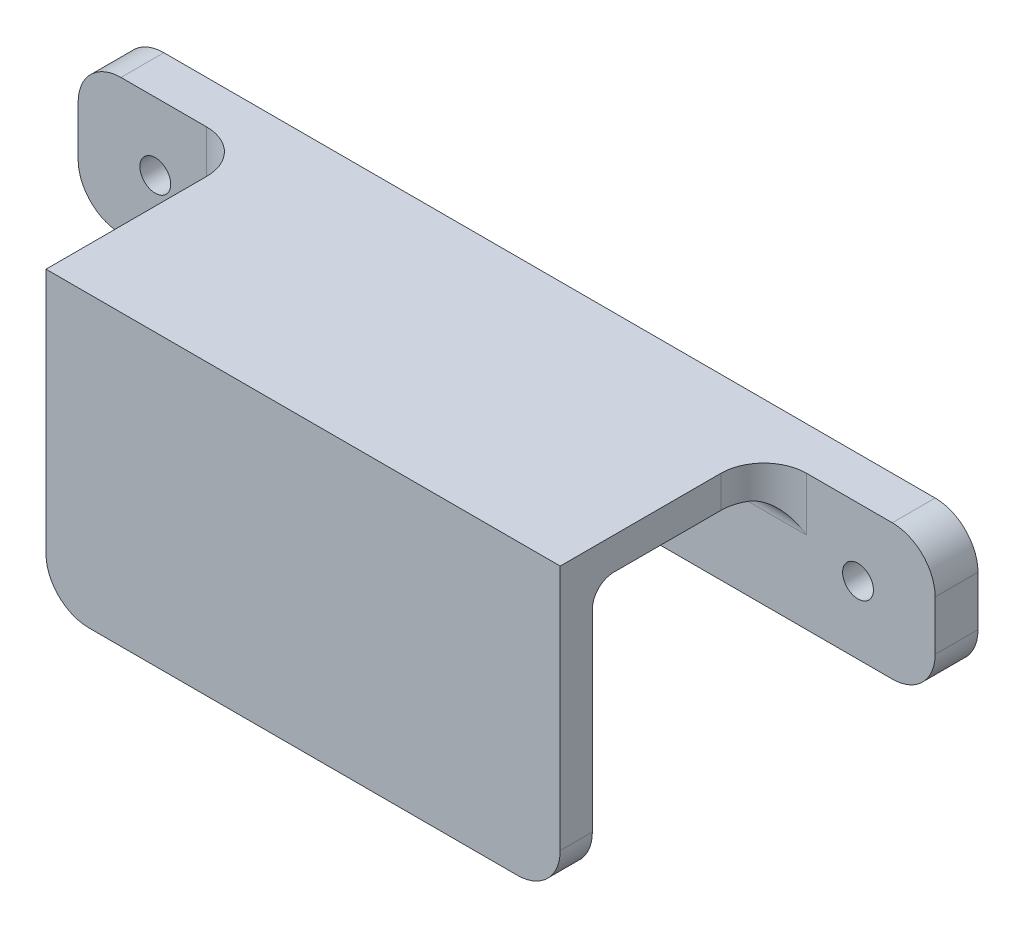
ISO-10303-21;
HEADER;
FILE_DESCRIPTION(('STEP AP214'),'2;1');
FILE_NAME('part.step','',(''),(''),'','','');
FILE_SCHEMA(('AUTOMOTIVE_DESIGN { 1 0 10303 214 1 1 1 1 }'));
ENDSEC;
DATA;
#1=APPLICATION_CONTEXT('core data for automotive mechanical design processes');
#2=APPLICATION_PROTOCOL_DEFINITION('international standard','automotive_design',2000,#1);
#3=PRODUCT_CONTEXT('',#1,'mechanical');
#4=PRODUCT('Part','Part','',(#3));
#5=PRODUCT_RELATED_PRODUCT_CATEGORY('part','',(#4));
#6=PRODUCT_DEFINITION_FORMATION('','',#4);
#7=PRODUCT_DEFINITION_CONTEXT('part definition',#1,'design');
#8=PRODUCT_DEFINITION('design','',#6,#7);
#9=PRODUCT_DEFINITION_SHAPE('','',#8);
#10=(LENGTH_UNIT() NAMED_UNIT(*) SI_UNIT(.MILLI.,.METRE.));
#11=(NAMED_UNIT(*) PLANE_ANGLE_UNIT() SI_UNIT($,.RADIAN.));
#12=(NAMED_UNIT(*) SI_UNIT($,.STERADIAN.) SOLID_ANGLE_UNIT());
#13=UNCERTAINTY_MEASURE_WITH_UNIT(LENGTH_MEASURE(1.E-05),#10,'distance_accuracy_value','');
#14=(GEOMETRIC_REPRESENTATION_CONTEXT(3) GLOBAL_UNCERTAINTY_ASSIGNED_CONTEXT((#13)) GLOBAL_UNIT_ASSIGNED_CONTEXT((#10,
#11,#12)) REPRESENTATION_CONTEXT('',''));
#15=CARTESIAN_POINT('',(0.,0.,0.));
#16=DIRECTION('',(0.,0.,1.));
#17=DIRECTION('',(1.,0.,0.));
#18=AXIS2_PLACEMENT_3D('',#15,#16,#17);
#19=CARTESIAN_POINT('',(0.,0.,6.35));
#20=DIRECTION('',(0.,0.,-1.));
#21=DIRECTION('',(-1.,0.,0.));
#22=AXIS2_PLACEMENT_3D('',#19,#20,#21);
#23=PLANE('',#22);
#24=CARTESIAN_POINT('',(52.07,0.,6.35));
#25=DIRECTION('',(0.,0.,-1.));
#26=DIRECTION('',(-1.,0.,0.));
#27=AXIS2_PLACEMENT_3D('',#24,#25,#26);
#28=CIRCLE('',#27,2.28599999999999);
#29=CARTESIAN_POINT('',(49.784,0.,6.35));
#30=VERTEX_POINT('',#29);
#31=EDGE_CURVE('E203',#30,#30,#28,.T.);
#32=ORIENTED_EDGE('',*,*,#31,.T.);
#33=EDGE_LOOP('',(#32));
#34=FACE_BOUND('',#33,.T.);
#35=CARTESIAN_POINT('',(-52.07,0.,6.35));
#36=DIRECTION('',(0.,0.,-1.));
#37=DIRECTION('',(-1.,0.,0.));
#38=AXIS2_PLACEMENT_3D('',#35,#36,#37);
#39=CIRCLE('',#38,2.28599999999999);
#40=CARTESIAN_POINT('',(-54.356,0.,6.35));
#41=VERTEX_POINT('',#40);
#42=EDGE_CURVE('E429',#41,#41,#39,.T.);
#43=ORIENTED_EDGE('',*,*,#42,.T.);
#44=EDGE_LOOP('',(#43));
#45=FACE_BOUND('',#44,.T.);
#46=DIRECTION('',(1.,0.,0.));
#47=VECTOR('',#46,1.);
#48=CARTESIAN_POINT('',(-38.1,2.0955,6.35));
#49=LINE('',#48,#47);
#50=CARTESIAN_POINT('',(44.45,2.0955,6.35));
#51=VERTEX_POINT('',#50);
#52=CARTESIAN_POINT('',(-44.45,2.0955,6.35));
#53=VERTEX_POINT('',#52);
#54=EDGE_CURVE('E295',#51,#53,#49,.F.);
#55=ORIENTED_EDGE('',*,*,#54,.T.);
#56=DIRECTION('',(0.,-1.,0.));
#57=VECTOR('',#56,1.);
#58=CARTESIAN_POINT('',(-44.45,10.033,6.35));
#59=LINE('',#58,#57);
#60=CARTESIAN_POINT('',(-44.45,10.033,6.35));
#61=VERTEX_POINT('',#60);
#62=EDGE_CURVE('E310',#53,#61,#59,.F.);
#63=ORIENTED_EDGE('',*,*,#62,.T.);
#64=DIRECTION('',(-1.,0.,0.));
#65=VECTOR('',#64,1.);
#66=CARTESIAN_POINT('',(-63.5,10.033,6.35));
#67=LINE('',#66,#65);
#68=CARTESIAN_POINT('',(-57.15,10.033,6.35));
#69=VERTEX_POINT('',#68);
#70=EDGE_CURVE('E218',#61,#69,#67,.T.);
#71=ORIENTED_EDGE('',*,*,#70,.T.);
#72=CARTESIAN_POINT('',(-57.15,3.683,6.35));
#73=DIRECTION('',(0.,0.,-1.));
#74=DIRECTION('',(-1.,0.,0.));
#75=AXIS2_PLACEMENT_3D('',#72,#73,#74);
#76=CIRCLE('',#75,6.35);
#77=CARTESIAN_POINT('',(-63.5,3.683,6.35));
#78=VERTEX_POINT('',#77);
#79=EDGE_CURVE('E263',#69,#78,#76,.F.);
#80=ORIENTED_EDGE('',*,*,#79,.T.);
#81=DIRECTION('',(0.,-1.,0.));
#82=VECTOR('',#81,1.);
#83=CARTESIAN_POINT('',(-63.5,-10.033,6.35));
#84=LINE('',#83,#82);
#85=CARTESIAN_POINT('',(-63.5,-3.683,6.35));
#86=VERTEX_POINT('',#85);
#87=EDGE_CURVE('E223',#78,#86,#84,.T.);
#88=ORIENTED_EDGE('',*,*,#87,.T.);
#89=CARTESIAN_POINT('',(-57.15,-3.683,6.35));
#90=DIRECTION('',(0.,0.,-1.));
#91=DIRECTION('',(-1.,0.,0.));
#92=AXIS2_PLACEMENT_3D('',#89,#90,#91);
#93=CIRCLE('',#92,6.35);
#94=CARTESIAN_POINT('',(-57.15,-10.033,6.35));
#95=VERTEX_POINT('',#94);
#96=EDGE_CURVE('E261',#86,#95,#93,.F.);
#97=ORIENTED_EDGE('',*,*,#96,.T.);
#98=DIRECTION('',(1.,0.,0.));
#99=VECTOR('',#98,1.);
#100=CARTESIAN_POINT('',(-63.5,-10.033,6.35));
#101=LINE('',#100,#99);
#102=CARTESIAN_POINT('',(57.15,-10.033,6.35));
#103=VERTEX_POINT('',#102);
#104=EDGE_CURVE('E226',#95,#103,#101,.T.);
#105=ORIENTED_EDGE('',*,*,#104,.T.);
#106=CARTESIAN_POINT('',(57.15,-3.683,6.35));
#107=DIRECTION('',(0.,0.,-1.));
#108=DIRECTION('',(-1.,0.,0.));
#109=AXIS2_PLACEMENT_3D('',#106,#107,#108);
#110=CIRCLE('',#109,6.35);
#111=CARTESIAN_POINT('',(63.5,-3.683,6.35));
#112=VERTEX_POINT('',#111);
#113=EDGE_CURVE('E259',#103,#112,#110,.F.);
#114=ORIENTED_EDGE('',*,*,#113,.T.);
#115=DIRECTION('',(0.,1.,0.));
#116=VECTOR('',#115,1.);
#117=CARTESIAN_POINT('',(63.5,-10.033,6.35));
#118=LINE('',#117,#116);
#119=CARTESIAN_POINT('',(63.5,3.683,6.35));
#120=VERTEX_POINT('',#119);
#121=EDGE_CURVE('E215',#112,#120,#118,.T.);
#122=ORIENTED_EDGE('',*,*,#121,.T.);
#123=CARTESIAN_POINT('',(57.15,3.683,6.35));
#124=DIRECTION('',(0.,0.,-1.));
#125=DIRECTION('',(-1.,0.,0.));
#126=AXIS2_PLACEMENT_3D('',#123,#124,#125);
#127=CIRCLE('',#126,6.35);
#128=CARTESIAN_POINT('',(57.15,10.033,6.35));
#129=VERTEX_POINT('',#128);
#130=EDGE_CURVE('E257',#120,#129,#127,.F.);
#131=ORIENTED_EDGE('',*,*,#130,.T.);
#132=CARTESIAN_POINT('',(44.45,10.033,6.35));
#133=VERTEX_POINT('',#132);
#134=EDGE_CURVE('E220',#129,#133,#67,.T.);
#135=ORIENTED_EDGE('',*,*,#134,.T.);
#136=DIRECTION('',(0.,1.,0.));
#137=VECTOR('',#136,1.);
#138=CARTESIAN_POINT('',(44.45,2.0955,6.35));
#139=LINE('',#138,#137);
#140=EDGE_CURVE('E307',#133,#51,#139,.F.);
#141=ORIENTED_EDGE('',*,*,#140,.T.);
#142=EDGE_LOOP('',(#55,#63,#71,#80,#88,#97,#105,#114,#122,#131,#135,#141));
#143=FACE_BOUND('',#142,.T.);
#144=ADVANCED_FACE('F32',(#34,#45,#143),#23,.F.);
#145=CARTESIAN_POINT('',(63.5,-10.033,6.35));
#146=DIRECTION('',(-1.,0.,0.));
#147=DIRECTION('',(0.,0.,1.));
#148=AXIS2_PLACEMENT_3D('',#145,#146,#147);
#149=PLANE('',#148);
#150=ORIENTED_EDGE('',*,*,#121,.F.);
#151=DIRECTION('',(0.,0.,-1.));
#152=VECTOR('',#151,1.);
#153=CARTESIAN_POINT('',(63.5,-3.683,6.35));
#154=LINE('',#153,#152);
#155=CARTESIAN_POINT('',(63.5,-3.683,0.));
#156=VERTEX_POINT('',#155);
#157=EDGE_CURVE('E272',#112,#156,#154,.T.);
#158=ORIENTED_EDGE('',*,*,#157,.T.);
#159=DIRECTION('',(0.,1.,0.));
#160=VECTOR('',#159,1.);
#161=CARTESIAN_POINT('',(63.5,-10.033,0.));
#162=LINE('',#161,#160);
#163=CARTESIAN_POINT('',(63.5,3.683,0.));
#164=VERTEX_POINT('',#163);
#165=EDGE_CURVE('E214',#156,#164,#162,.T.);
#166=ORIENTED_EDGE('',*,*,#165,.T.);
#167=DIRECTION('',(0.,0.,-1.));
#168=VECTOR('',#167,1.);
#169=CARTESIAN_POINT('',(63.5,3.683,6.35));
#170=LINE('',#169,#168);
#171=EDGE_CURVE('E270',#164,#120,#170,.F.);
#172=ORIENTED_EDGE('',*,*,#171,.T.);
#173=EDGE_LOOP('',(#150,#158,#166,#172));
#174=FACE_BOUND('',#173,.T.);
#175=ADVANCED_FACE('F341',(#174),#149,.F.);
#176=CARTESIAN_POINT('',(-63.5,10.033,6.35));
#177=DIRECTION('',(0.,-1.,0.));
#178=DIRECTION('',(0.,0.,-1.));
#179=AXIS2_PLACEMENT_3D('',#176,#177,#178);
#180=PLANE('',#179);
#181=DIRECTION('',(-1.,0.,0.));
#182=VECTOR('',#181,1.);
#183=CARTESIAN_POINT('',(-63.5,10.033,0.));
#184=LINE('',#183,#182);
#185=CARTESIAN_POINT('',(57.15,10.033,0.));
#186=VERTEX_POINT('',#185);
#187=CARTESIAN_POINT('',(-57.15,10.033,0.));
#188=VERTEX_POINT('',#187);
#189=EDGE_CURVE('E232',#186,#188,#184,.T.);
#190=ORIENTED_EDGE('',*,*,#189,.T.);
#191=DIRECTION('',(0.,0.,-1.));
#192=VECTOR('',#191,1.);
#193=CARTESIAN_POINT('',(-57.15,10.033,6.35));
#194=LINE('',#193,#192);
#195=EDGE_CURVE('E254',#188,#69,#194,.F.);
#196=ORIENTED_EDGE('',*,*,#195,.T.);
#197=ORIENTED_EDGE('',*,*,#70,.F.);
#198=CARTESIAN_POINT('',(-44.45,10.033,12.7));
#199=DIRECTION('',(0.,-1.,0.));
#200=DIRECTION('',(0.,0.,-1.));
#201=AXIS2_PLACEMENT_3D('',#198,#199,#200);
#202=CIRCLE('',#201,6.35);
#203=CARTESIAN_POINT('',(-38.1,10.033,12.7));
#204=VERTEX_POINT('',#203);
#205=EDGE_CURVE('E322',#61,#204,#202,.T.);
#206=ORIENTED_EDGE('',*,*,#205,.T.);
#207=DIRECTION('',(0.,0.,-1.));
#208=VECTOR('',#207,1.);
#209=CARTESIAN_POINT('',(-38.1,10.033,31.75));
#210=LINE('',#209,#208);
#211=CARTESIAN_POINT('',(-38.1,10.033,36.5125));
#212=VERTEX_POINT('',#211);
#213=EDGE_CURVE('E191',#212,#204,#210,.T.);
#214=ORIENTED_EDGE('',*,*,#213,.F.);
#215=DIRECTION('',(-1.,0.,0.));
#216=VECTOR('',#215,1.);
#217=CARTESIAN_POINT('',(-38.1,10.033,36.5125));
#218=LINE('',#217,#216);
#219=CARTESIAN_POINT('',(38.1,10.033,36.5125));
#220=VERTEX_POINT('',#219);
#221=EDGE_CURVE('E172',#220,#212,#218,.T.);
#222=ORIENTED_EDGE('',*,*,#221,.F.);
#223=DIRECTION('',(0.,0.,-1.));
#224=VECTOR('',#223,1.);
#225=CARTESIAN_POINT('',(38.1,10.033,31.75));
#226=LINE('',#225,#224);
#227=CARTESIAN_POINT('',(38.1,10.033,12.7));
#228=VERTEX_POINT('',#227);
#229=EDGE_CURVE('E184',#220,#228,#226,.T.);
#230=ORIENTED_EDGE('',*,*,#229,.T.);
#231=CARTESIAN_POINT('',(44.45,10.033,12.7));
#232=DIRECTION('',(0.,-1.,0.));
#233=DIRECTION('',(0.,0.,-1.));
#234=AXIS2_PLACEMENT_3D('',#231,#232,#233);
#235=CIRCLE('',#234,6.35);
#236=EDGE_CURVE('E408',#228,#133,#235,.T.);
#237=ORIENTED_EDGE('',*,*,#236,.T.);
#238=ORIENTED_EDGE('',*,*,#134,.F.);
#239=DIRECTION('',(0.,0.,-1.));
#240=VECTOR('',#239,1.);
#241=CARTESIAN_POINT('',(57.15,10.033,6.35));
#242=LINE('',#241,#240);
#243=EDGE_CURVE('E251',#129,#186,#242,.T.);
#244=ORIENTED_EDGE('',*,*,#243,.T.);
#245=EDGE_LOOP('',(#190,#196,#197,#206,#214,#222,#230,#237,#238,#244));
#246=FACE_BOUND('',#245,.T.);
#247=ADVANCED_FACE('F194',(#246),#180,.F.);
#248=CARTESIAN_POINT('',(-63.5,-10.033,6.35));
#249=DIRECTION('',(1.,0.,0.));
#250=DIRECTION('',(0.,0.,-1.));
#251=AXIS2_PLACEMENT_3D('',#248,#249,#250);
#252=PLANE('',#251);
#253=ORIENTED_EDGE('',*,*,#87,.F.);
#254=DIRECTION('',(0.,0.,-1.));
#255=VECTOR('',#254,1.);
#256=CARTESIAN_POINT('',(-63.5,3.683,6.35));
#257=LINE('',#256,#255);
#258=CARTESIAN_POINT('',(-63.5,3.683,0.));
#259=VERTEX_POINT('',#258);
#260=EDGE_CURVE('E240',#78,#259,#257,.T.);
#261=ORIENTED_EDGE('',*,*,#260,.T.);
#262=DIRECTION('',(0.,-1.,0.));
#263=VECTOR('',#262,1.);
#264=CARTESIAN_POINT('',(-63.5,-10.033,0.));
#265=LINE('',#264,#263);
#266=CARTESIAN_POINT('',(-63.5,-3.683,0.));
#267=VERTEX_POINT('',#266);
#268=EDGE_CURVE('E234',#259,#267,#265,.T.);
#269=ORIENTED_EDGE('',*,*,#268,.T.);
#270=DIRECTION('',(0.,0.,-1.));
#271=VECTOR('',#270,1.);
#272=CARTESIAN_POINT('',(-63.5,-3.683,6.35));
#273=LINE('',#272,#271);
#274=EDGE_CURVE('E229',#267,#86,#273,.F.);
#275=ORIENTED_EDGE('',*,*,#274,.T.);
#276=EDGE_LOOP('',(#253,#261,#269,#275));
#277=FACE_BOUND('',#276,.T.);
#278=ADVANCED_FACE('F362',(#277),#252,.F.);
#279=CARTESIAN_POINT('',(-63.5,-10.033,6.35));
#280=DIRECTION('',(0.,1.,0.));
#281=DIRECTION('',(0.,0.,1.));
#282=AXIS2_PLACEMENT_3D('',#279,#280,#281);
#283=PLANE('',#282);
#284=ORIENTED_EDGE('',*,*,#104,.F.);
#285=DIRECTION('',(0.,0.,-1.));
#286=VECTOR('',#285,1.);
#287=CARTESIAN_POINT('',(-57.15,-10.033,6.35));
#288=LINE('',#287,#286);
#289=CARTESIAN_POINT('',(-57.15,-10.033,0.));
#290=VERTEX_POINT('',#289);
#291=EDGE_CURVE('E267',#95,#290,#288,.T.);
#292=ORIENTED_EDGE('',*,*,#291,.T.);
#293=DIRECTION('',(1.,0.,0.));
#294=VECTOR('',#293,1.);
#295=CARTESIAN_POINT('',(-63.5,-10.033,0.));
#296=LINE('',#295,#294);
#297=CARTESIAN_POINT('',(57.15,-10.033,0.));
#298=VERTEX_POINT('',#297);
#299=EDGE_CURVE('E219',#290,#298,#296,.T.);
#300=ORIENTED_EDGE('',*,*,#299,.T.);
#301=DIRECTION('',(0.,0.,-1.));
#302=VECTOR('',#301,1.);
#303=CARTESIAN_POINT('',(57.15,-10.033,6.35));
#304=LINE('',#303,#302);
#305=EDGE_CURVE('E265',#298,#103,#304,.F.);
#306=ORIENTED_EDGE('',*,*,#305,.T.);
#307=EDGE_LOOP('',(#284,#292,#300,#306));
#308=FACE_BOUND('',#307,.T.);
#309=ADVANCED_FACE('F358',(#308),#283,.F.);
#310=CARTESIAN_POINT('',(0.,0.,0.));
#311=DIRECTION('',(0.,0.,-1.));
#312=DIRECTION('',(-1.,0.,0.));
#313=AXIS2_PLACEMENT_3D('',#310,#311,#312);
#314=PLANE('',#313);
#315=CARTESIAN_POINT('',(52.07,0.,0.));
#316=DIRECTION('',(0.,0.,-1.));
#317=DIRECTION('',(-1.,0.,0.));
#318=AXIS2_PLACEMENT_3D('',#315,#316,#317);
#319=CIRCLE('',#318,2.28599999999999);
#320=CARTESIAN_POINT('',(49.784,0.,0.));
#321=VERTEX_POINT('',#320);
#322=EDGE_CURVE('E432',#321,#321,#319,.T.);
#323=ORIENTED_EDGE('',*,*,#322,.F.);
#324=EDGE_LOOP('',(#323));
#325=FACE_BOUND('',#324,.T.);
#326=CARTESIAN_POINT('',(-52.07,0.,0.));
#327=DIRECTION('',(0.,0.,-1.));
#328=DIRECTION('',(-1.,0.,0.));
#329=AXIS2_PLACEMENT_3D('',#326,#327,#328);
#330=CIRCLE('',#329,2.28599999999999);
#331=CARTESIAN_POINT('',(-54.356,0.,0.));
#332=VERTEX_POINT('',#331);
#333=EDGE_CURVE('E433',#332,#332,#330,.T.);
#334=ORIENTED_EDGE('',*,*,#333,.F.);
#335=EDGE_LOOP('',(#334));
#336=FACE_BOUND('',#335,.T.);
#337=ORIENTED_EDGE('',*,*,#268,.F.);
#338=CARTESIAN_POINT('',(-57.15,3.683,0.));
#339=DIRECTION('',(0.,0.,-1.));
#340=DIRECTION('',(-1.,0.,0.));
#341=AXIS2_PLACEMENT_3D('',#338,#339,#340);
#342=CIRCLE('',#341,6.35);
#343=EDGE_CURVE('E249',#259,#188,#342,.T.);
#344=ORIENTED_EDGE('',*,*,#343,.T.);
#345=ORIENTED_EDGE('',*,*,#189,.F.);
#346=CARTESIAN_POINT('',(57.15,3.683,0.));
#347=DIRECTION('',(0.,0.,-1.));
#348=DIRECTION('',(-1.,0.,0.));
#349=AXIS2_PLACEMENT_3D('',#346,#347,#348);
#350=CIRCLE('',#349,6.35);
#351=EDGE_CURVE('E243',#186,#164,#350,.T.);
#352=ORIENTED_EDGE('',*,*,#351,.T.);
#353=ORIENTED_EDGE('',*,*,#165,.F.);
#354=CARTESIAN_POINT('',(57.15,-3.683,0.));
#355=DIRECTION('',(0.,0.,-1.));
#356=DIRECTION('',(-1.,0.,0.));
#357=AXIS2_PLACEMENT_3D('',#354,#355,#356);
#358=CIRCLE('',#357,6.35);
#359=EDGE_CURVE('E245',#156,#298,#358,.T.);
#360=ORIENTED_EDGE('',*,*,#359,.T.);
#361=ORIENTED_EDGE('',*,*,#299,.F.);
#362=CARTESIAN_POINT('',(-57.15,-3.683,0.));
#363=DIRECTION('',(0.,0.,-1.));
#364=DIRECTION('',(-1.,0.,0.));
#365=AXIS2_PLACEMENT_3D('',#362,#363,#364);
#366=CIRCLE('',#365,6.35);
#367=EDGE_CURVE('E247',#290,#267,#366,.T.);
#368=ORIENTED_EDGE('',*,*,#367,.T.);
#369=EDGE_LOOP('',(#337,#344,#345,#352,#353,#360,#361,#368));
#370=FACE_BOUND('',#369,.T.);
#371=ADVANCED_FACE('F355',(#325,#336,#370),#314,.T.);
#372=CARTESIAN_POINT('',(-38.1,10.033,31.75));
#373=DIRECTION('',(1.,0.,0.));
#374=DIRECTION('',(0.,1.,0.));
#375=AXIS2_PLACEMENT_3D('',#372,#373,#374);
#376=PLANE('',#375);
#377=ORIENTED_EDGE('',*,*,#213,.T.);
#378=DIRECTION('',(0.,-1.,0.));
#379=VECTOR('',#378,1.);
#380=CARTESIAN_POINT('',(-38.1,2.0955,12.7));
#381=LINE('',#380,#379);
#382=CARTESIAN_POINT('',(-38.1,5.2705,12.7));
#383=VERTEX_POINT('',#382);
#384=EDGE_CURVE('E304',#204,#383,#381,.T.);
#385=ORIENTED_EDGE('',*,*,#384,.T.);
#386=DIRECTION('',(0.,0.,-1.));
#387=VECTOR('',#386,1.);
#388=CARTESIAN_POINT('',(-38.1,5.2705,31.75));
#389=LINE('',#388,#387);
#390=CARTESIAN_POINT('',(-38.1,5.2705,28.575));
#391=VERTEX_POINT('',#390);
#392=EDGE_CURVE('E211',#391,#383,#389,.T.);
#393=ORIENTED_EDGE('',*,*,#392,.F.);
#394=CARTESIAN_POINT('',(-38.1,2.0955,28.575));
#395=DIRECTION('',(1.,0.,0.));
#396=DIRECTION('',(0.,1.,0.));
#397=AXIS2_PLACEMENT_3D('',#394,#395,#396);
#398=CIRCLE('',#397,3.175);
#399=CARTESIAN_POINT('',(-38.1,2.0955,31.75));
#400=VERTEX_POINT('',#399);
#401=EDGE_CURVE('E302',#391,#400,#398,.T.);
#402=ORIENTED_EDGE('',*,*,#401,.T.);
#403=DIRECTION('',(0.,-1.,0.));
#404=VECTOR('',#403,1.);
#405=CARTESIAN_POINT('',(-38.1,10.033,31.75));
#406=LINE('',#405,#404);
#407=CARTESIAN_POINT('',(-38.1,-26.4795,31.75));
#408=VERTEX_POINT('',#407);
#409=EDGE_CURVE('E200',#400,#408,#406,.T.);
#410=ORIENTED_EDGE('',*,*,#409,.T.);
#411=DIRECTION('',(0.,0.,-1.));
#412=VECTOR('',#411,1.);
#413=CARTESIAN_POINT('',(-38.1000000000001,-26.4795,31.75));
#414=LINE('',#413,#412);
#415=CARTESIAN_POINT('',(-38.1,-26.4795,36.5125));
#416=VERTEX_POINT('',#415);
#417=EDGE_CURVE('E285',#408,#416,#414,.F.);
#418=ORIENTED_EDGE('',*,*,#417,.T.);
#419=DIRECTION('',(0.,-1.,0.));
#420=VECTOR('',#419,1.);
#421=CARTESIAN_POINT('',(-38.1,10.033,36.5125));
#422=LINE('',#421,#420);
#423=EDGE_CURVE('E208',#212,#416,#422,.T.);
#424=ORIENTED_EDGE('',*,*,#423,.F.);
#425=EDGE_LOOP('',(#377,#385,#393,#402,#410,#418,#424));
#426=FACE_BOUND('',#425,.T.);
#427=ADVANCED_FACE('F353',(#426),#376,.F.);
#428=CARTESIAN_POINT('',(-38.1,5.2705,31.75));
#429=DIRECTION('',(0.,1.,0.));
#430=DIRECTION('',(0.,0.,1.));
#431=AXIS2_PLACEMENT_3D('',#428,#429,#430);
#432=PLANE('',#431);
#433=ORIENTED_EDGE('',*,*,#392,.T.);
#434=CARTESIAN_POINT('',(-44.45,5.2705,12.7));
#435=DIRECTION('',(0.,1.,0.));
#436=DIRECTION('',(0.,0.,1.));
#437=AXIS2_PLACEMENT_3D('',#434,#435,#436);
#438=CIRCLE('',#437,6.35);
#439=CARTESIAN_POINT('',(-38.9507386859688,5.2705,9.525));
#440=VERTEX_POINT('',#439);
#441=EDGE_CURVE('E313',#383,#440,#438,.T.);
#442=ORIENTED_EDGE('',*,*,#441,.T.);
#443=DIRECTION('',(1.,0.,0.));
#444=VECTOR('',#443,1.);
#445=CARTESIAN_POINT('',(38.1,5.2705,9.525));
#446=LINE('',#445,#444);
#447=CARTESIAN_POINT('',(38.9507386859688,5.2705,9.525));
#448=VERTEX_POINT('',#447);
#449=EDGE_CURVE('E47',#440,#448,#446,.T.);
#450=ORIENTED_EDGE('',*,*,#449,.T.);
#451=CARTESIAN_POINT('',(44.45,5.2705,12.7));
#452=DIRECTION('',(0.,1.,0.));
#453=DIRECTION('',(0.,0.,1.));
#454=AXIS2_PLACEMENT_3D('',#451,#452,#453);
#455=CIRCLE('',#454,6.35);
#456=CARTESIAN_POINT('',(38.1,5.2705,12.7));
#457=VERTEX_POINT('',#456);
#458=EDGE_CURVE('E11',#448,#457,#455,.T.);
#459=ORIENTED_EDGE('',*,*,#458,.T.);
#460=DIRECTION('',(0.,0.,-1.));
#461=VECTOR('',#460,1.);
#462=CARTESIAN_POINT('',(38.1,5.2705,31.75));
#463=LINE('',#462,#461);
#464=CARTESIAN_POINT('',(38.1,5.2705,28.575));
#465=VERTEX_POINT('',#464);
#466=EDGE_CURVE('E190',#465,#457,#463,.T.);
#467=ORIENTED_EDGE('',*,*,#466,.F.);
#468=DIRECTION('',(1.,0.,0.));
#469=VECTOR('',#468,1.);
#470=CARTESIAN_POINT('',(-38.1,5.2705,28.575));
#471=LINE('',#470,#469);
#472=EDGE_CURVE('E292',#465,#391,#471,.F.);
#473=ORIENTED_EDGE('',*,*,#472,.T.);
#474=EDGE_LOOP('',(#433,#442,#450,#459,#467,#473));
#475=FACE_BOUND('',#474,.T.);
#476=ADVANCED_FACE('F402',(#475),#432,.F.);
#477=CARTESIAN_POINT('',(38.1,10.033,31.75));
#478=DIRECTION('',(-1.,0.,0.));
#479=DIRECTION('',(0.,0.,1.));
#480=AXIS2_PLACEMENT_3D('',#477,#478,#479);
#481=PLANE('',#480);
#482=ORIENTED_EDGE('',*,*,#466,.T.);
#483=DIRECTION('',(0.,1.,0.));
#484=VECTOR('',#483,1.);
#485=CARTESIAN_POINT('',(38.1,10.033,12.7));
#486=LINE('',#485,#484);
#487=EDGE_CURVE('E188',#457,#228,#486,.T.);
#488=ORIENTED_EDGE('',*,*,#487,.T.);
#489=ORIENTED_EDGE('',*,*,#229,.F.);
#490=DIRECTION('',(0.,1.,0.));
#491=VECTOR('',#490,1.);
#492=CARTESIAN_POINT('',(38.1,10.033,36.5125));
#493=LINE('',#492,#491);
#494=CARTESIAN_POINT('',(38.1,-26.4795,36.5125));
#495=VERTEX_POINT('',#494);
#496=EDGE_CURVE('E167',#495,#220,#493,.T.);
#497=ORIENTED_EDGE('',*,*,#496,.F.);
#498=DIRECTION('',(0.,0.,-1.));
#499=VECTOR('',#498,1.);
#500=CARTESIAN_POINT('',(38.1,-26.4795,31.75));
#501=LINE('',#500,#499);
#502=CARTESIAN_POINT('',(38.1,-26.4795,31.75));
#503=VERTEX_POINT('',#502);
#504=EDGE_CURVE('E290',#495,#503,#501,.T.);
#505=ORIENTED_EDGE('',*,*,#504,.T.);
#506=DIRECTION('',(0.,1.,0.));
#507=VECTOR('',#506,1.);
#508=CARTESIAN_POINT('',(38.1,10.033,31.75));
#509=LINE('',#508,#507);
#510=CARTESIAN_POINT('',(38.1,2.0955,31.75));
#511=VERTEX_POINT('',#510);
#512=EDGE_CURVE('E206',#503,#511,#509,.T.);
#513=ORIENTED_EDGE('',*,*,#512,.T.);
#514=CARTESIAN_POINT('',(38.1,2.0955,28.575));
#515=DIRECTION('',(-1.,0.,0.));
#516=DIRECTION('',(0.,0.,1.));
#517=AXIS2_PLACEMENT_3D('',#514,#515,#516);
#518=CIRCLE('',#517,3.175);
#519=EDGE_CURVE('E300',#511,#465,#518,.T.);
#520=ORIENTED_EDGE('',*,*,#519,.T.);
#521=EDGE_LOOP('',(#482,#488,#489,#497,#505,#513,#520));
#522=FACE_BOUND('',#521,.T.);
#523=ADVANCED_FACE('F186',(#522),#481,.F.);
#524=CARTESIAN_POINT('',(0.,0.,31.75));
#525=DIRECTION('',(0.,0.,1.));
#526=DIRECTION('',(1.,0.,0.));
#527=AXIS2_PLACEMENT_3D('',#524,#525,#526);
#528=PLANE('',#527);
#529=ORIENTED_EDGE('',*,*,#409,.F.);
#530=DIRECTION('',(1.,0.,0.));
#531=VECTOR('',#530,1.);
#532=CARTESIAN_POINT('',(38.1,2.0955,31.75));
#533=LINE('',#532,#531);
#534=EDGE_CURVE('E297',#400,#511,#533,.T.);
#535=ORIENTED_EDGE('',*,*,#534,.T.);
#536=ORIENTED_EDGE('',*,*,#512,.F.);
#537=CARTESIAN_POINT('',(31.75,-26.4795,31.75));
#538=DIRECTION('',(0.,0.,1.));
#539=DIRECTION('',(1.,0.,0.));
#540=AXIS2_PLACEMENT_3D('',#537,#538,#539);
#541=CIRCLE('',#540,6.35);
#542=CARTESIAN_POINT('',(31.75,-32.8295,31.75));
#543=VERTEX_POINT('',#542);
#544=EDGE_CURVE('E280',#503,#543,#541,.F.);
#545=ORIENTED_EDGE('',*,*,#544,.T.);
#546=DIRECTION('',(1.,0.,0.));
#547=VECTOR('',#546,1.);
#548=CARTESIAN_POINT('',(-38.1,-32.8295,31.75));
#549=LINE('',#548,#547);
#550=CARTESIAN_POINT('',(-31.75,-32.8295,31.75));
#551=VERTEX_POINT('',#550);
#552=EDGE_CURVE('E202',#551,#543,#549,.T.);
#553=ORIENTED_EDGE('',*,*,#552,.F.);
#554=CARTESIAN_POINT('',(-31.75,-26.4795,31.75));
#555=DIRECTION('',(0.,0.,1.));
#556=DIRECTION('',(1.,0.,0.));
#557=AXIS2_PLACEMENT_3D('',#554,#555,#556);
#558=CIRCLE('',#557,6.35);
#559=EDGE_CURVE('E282',#551,#408,#558,.F.);
#560=ORIENTED_EDGE('',*,*,#559,.T.);
#561=EDGE_LOOP('',(#529,#535,#536,#545,#553,#560));
#562=FACE_BOUND('',#561,.T.);
#563=ADVANCED_FACE('F397',(#562),#528,.F.);
#564=CARTESIAN_POINT('',(-38.1,-32.8295,36.5125));
#565=DIRECTION('',(0.,1.,0.));
#566=DIRECTION('',(0.,0.,1.));
#567=AXIS2_PLACEMENT_3D('',#564,#565,#566);
#568=PLANE('',#567);
#569=DIRECTION('',(1.,0.,0.));
#570=VECTOR('',#569,1.);
#571=CARTESIAN_POINT('',(-38.1,-32.8295,36.5125));
#572=LINE('',#571,#570);
#573=CARTESIAN_POINT('',(-31.75,-32.8295,36.5125));
#574=VERTEX_POINT('',#573);
#575=CARTESIAN_POINT('',(31.75,-32.8295,36.5125));
#576=VERTEX_POINT('',#575);
#577=EDGE_CURVE('E180',#574,#576,#572,.T.);
#578=ORIENTED_EDGE('',*,*,#577,.F.);
#579=DIRECTION('',(0.,0.,-1.));
#580=VECTOR('',#579,1.);
#581=CARTESIAN_POINT('',(-31.75,-32.8295,36.5125));
#582=LINE('',#581,#580);
#583=EDGE_CURVE('E277',#574,#551,#582,.T.);
#584=ORIENTED_EDGE('',*,*,#583,.T.);
#585=ORIENTED_EDGE('',*,*,#552,.T.);
#586=DIRECTION('',(0.,0.,-1.));
#587=VECTOR('',#586,1.);
#588=CARTESIAN_POINT('',(31.75,-32.8295,36.5125));
#589=LINE('',#588,#587);
#590=EDGE_CURVE('E275',#543,#576,#589,.F.);
#591=ORIENTED_EDGE('',*,*,#590,.T.);
#592=EDGE_LOOP('',(#578,#584,#585,#591));
#593=FACE_BOUND('',#592,.T.);
#594=ADVANCED_FACE('F425',(#593),#568,.F.);
#595=CARTESIAN_POINT('',(0.,0.,36.5125));
#596=DIRECTION('',(0.,0.,1.));
#597=DIRECTION('',(1.,0.,0.));
#598=AXIS2_PLACEMENT_3D('',#595,#596,#597);
#599=PLANE('',#598);
#600=ORIENTED_EDGE('',*,*,#423,.T.);
#601=CARTESIAN_POINT('',(-31.75,-26.4795,36.5125));
#602=DIRECTION('',(0.,0.,1.));
#603=DIRECTION('',(1.,0.,0.));
#604=AXIS2_PLACEMENT_3D('',#601,#602,#603);
#605=CIRCLE('',#604,6.35);
#606=EDGE_CURVE('E288',#416,#574,#605,.T.);
#607=ORIENTED_EDGE('',*,*,#606,.T.);
#608=ORIENTED_EDGE('',*,*,#577,.T.);
#609=CARTESIAN_POINT('',(31.75,-26.4795,36.5125));
#610=DIRECTION('',(0.,0.,1.));
#611=DIRECTION('',(1.,0.,0.));
#612=AXIS2_PLACEMENT_3D('',#609,#610,#611);
#613=CIRCLE('',#612,6.35);
#614=EDGE_CURVE('E176',#576,#495,#613,.T.);
#615=ORIENTED_EDGE('',*,*,#614,.T.);
#616=ORIENTED_EDGE('',*,*,#496,.T.);
#617=ORIENTED_EDGE('',*,*,#221,.T.);
#618=EDGE_LOOP('',(#600,#607,#608,#615,#616,#617));
#619=FACE_BOUND('',#618,.T.);
#620=ADVANCED_FACE('F170',(#619),#599,.T.);
#621=CARTESIAN_POINT('',(-52.07,0.,36.5125));
#622=DIRECTION('',(0.,0.,-1.));
#623=DIRECTION('',(-1.,0.,0.));
#624=AXIS2_PLACEMENT_3D('',#621,#622,#623);
#625=CYLINDRICAL_SURFACE('',#624,2.28599999999999);
#626=ORIENTED_EDGE('',*,*,#333,.T.);
#627=EDGE_LOOP('',(#626));
#628=FACE_BOUND('',#627,.T.);
#629=ORIENTED_EDGE('',*,*,#42,.F.);
#630=EDGE_LOOP('',(#629));
#631=FACE_BOUND('',#630,.T.);
#632=ADVANCED_FACE('F464',(#628,#631),#625,.F.);
#633=CARTESIAN_POINT('',(52.07,0.,36.5125));
#634=DIRECTION('',(0.,0.,-1.));
#635=DIRECTION('',(-1.,0.,0.));
#636=AXIS2_PLACEMENT_3D('',#633,#634,#635);
#637=CYLINDRICAL_SURFACE('',#636,2.28599999999999);
#638=ORIENTED_EDGE('',*,*,#322,.T.);
#639=EDGE_LOOP('',(#638));
#640=FACE_BOUND('',#639,.T.);
#641=ORIENTED_EDGE('',*,*,#31,.F.);
#642=EDGE_LOOP('',(#641));
#643=FACE_BOUND('',#642,.T.);
#644=ADVANCED_FACE('F373',(#640,#643),#637,.F.);
#645=CARTESIAN_POINT('',(-57.15,3.683,6.35));
#646=DIRECTION('',(0.,0.,-1.));
#647=DIRECTION('',(-1.,0.,0.));
#648=AXIS2_PLACEMENT_3D('',#645,#646,#647);
#649=CYLINDRICAL_SURFACE('',#648,6.35);
#650=ORIENTED_EDGE('',*,*,#79,.F.);
#651=ORIENTED_EDGE('',*,*,#195,.F.);
#652=ORIENTED_EDGE('',*,*,#343,.F.);
#653=ORIENTED_EDGE('',*,*,#260,.F.);
#654=EDGE_LOOP('',(#650,#651,#652,#653));
#655=FACE_BOUND('',#654,.T.);
#656=ADVANCED_FACE('F369',(#655),#649,.T.);
#657=CARTESIAN_POINT('',(-57.15,-3.683,6.35));
#658=DIRECTION('',(0.,0.,-1.));
#659=DIRECTION('',(-1.,0.,0.));
#660=AXIS2_PLACEMENT_3D('',#657,#658,#659);
#661=CYLINDRICAL_SURFACE('',#660,6.35);
#662=ORIENTED_EDGE('',*,*,#96,.F.);
#663=ORIENTED_EDGE('',*,*,#274,.F.);
#664=ORIENTED_EDGE('',*,*,#367,.F.);
#665=ORIENTED_EDGE('',*,*,#291,.F.);
#666=EDGE_LOOP('',(#662,#663,#664,#665));
#667=FACE_BOUND('',#666,.T.);
#668=ADVANCED_FACE('F372',(#667),#661,.T.);
#669=CARTESIAN_POINT('',(57.15,-3.683,6.35));
#670=DIRECTION('',(0.,0.,-1.));
#671=DIRECTION('',(-1.,0.,0.));
#672=AXIS2_PLACEMENT_3D('',#669,#670,#671);
#673=CYLINDRICAL_SURFACE('',#672,6.35);
#674=ORIENTED_EDGE('',*,*,#113,.F.);
#675=ORIENTED_EDGE('',*,*,#305,.F.);
#676=ORIENTED_EDGE('',*,*,#359,.F.);
#677=ORIENTED_EDGE('',*,*,#157,.F.);
#678=EDGE_LOOP('',(#674,#675,#676,#677));
#679=FACE_BOUND('',#678,.T.);
#680=ADVANCED_FACE('F377',(#679),#673,.T.);
#681=CARTESIAN_POINT('',(57.15,3.683,6.35));
#682=DIRECTION('',(0.,0.,-1.));
#683=DIRECTION('',(-1.,0.,0.));
#684=AXIS2_PLACEMENT_3D('',#681,#682,#683);
#685=CYLINDRICAL_SURFACE('',#684,6.35);
#686=ORIENTED_EDGE('',*,*,#130,.F.);
#687=ORIENTED_EDGE('',*,*,#171,.F.);
#688=ORIENTED_EDGE('',*,*,#351,.F.);
#689=ORIENTED_EDGE('',*,*,#243,.F.);
#690=EDGE_LOOP('',(#686,#687,#688,#689));
#691=FACE_BOUND('',#690,.T.);
#692=ADVANCED_FACE('F381',(#691),#685,.T.);
#693=CARTESIAN_POINT('',(-31.75,-26.4795,36.5125));
#694=DIRECTION('',(0.,0.,-1.));
#695=DIRECTION('',(-1.,0.,0.));
#696=AXIS2_PLACEMENT_3D('',#693,#694,#695);
#697=CYLINDRICAL_SURFACE('',#696,6.35);
#698=ORIENTED_EDGE('',*,*,#606,.F.);
#699=ORIENTED_EDGE('',*,*,#417,.F.);
#700=ORIENTED_EDGE('',*,*,#559,.F.);
#701=ORIENTED_EDGE('',*,*,#583,.F.);
#702=EDGE_LOOP('',(#698,#699,#700,#701));
#703=FACE_BOUND('',#702,.T.);
#704=ADVANCED_FACE('F385',(#703),#697,.T.);
#705=CARTESIAN_POINT('',(31.75,-26.4795,31.75));
#706=DIRECTION('',(0.,0.,-1.));
#707=DIRECTION('',(-1.,0.,0.));
#708=AXIS2_PLACEMENT_3D('',#705,#706,#707);
#709=CYLINDRICAL_SURFACE('',#708,6.35);
#710=ORIENTED_EDGE('',*,*,#614,.F.);
#711=ORIENTED_EDGE('',*,*,#590,.F.);
#712=ORIENTED_EDGE('',*,*,#544,.F.);
#713=ORIENTED_EDGE('',*,*,#504,.F.);
#714=EDGE_LOOP('',(#710,#711,#712,#713));
#715=FACE_BOUND('',#714,.T.);
#716=ADVANCED_FACE('F338',(#715),#709,.T.);
#717=CARTESIAN_POINT('',(-38.1,2.0955,9.525));
#718=DIRECTION('',(-1.,0.,0.));
#719=DIRECTION('',(0.,0.,1.));
#720=AXIS2_PLACEMENT_3D('',#717,#718,#719);
#721=CYLINDRICAL_SURFACE('',#720,3.175);
#722=ORIENTED_EDGE('',*,*,#449,.F.);
#723=CARTESIAN_POINT('',(-38.9507386859688,5.2705,9.525));
#724=CARTESIAN_POINT('',(-39.0193551666433,5.27050083241405,9.40606717041622));
#725=CARTESIAN_POINT('',(-39.0918212768672,5.2638224739168,9.28954029641295));
#726=CARTESIAN_POINT('',(-39.243291561642,5.23870740511547,9.0625408518717));
#727=CARTESIAN_POINT('',(-39.3222787351328,5.22030047920231,8.95205371306059));
#728=CARTESIAN_POINT('',(-39.4849026540729,5.17362360230719,8.73918411211584));
#729=CARTESIAN_POINT('',(-39.5684639517482,5.14548752769042,8.6367136805631));
#730=CARTESIAN_POINT('',(-39.7403827515528,5.08068123055208,8.4386374715108));
#731=CARTESIAN_POINT('',(-39.8287437454758,5.04400472932282,8.34303681249153));
#732=CARTESIAN_POINT('',(-40.0266621802346,4.95570765337377,8.14147560034558));
#733=CARTESIAN_POINT('',(-40.1370558135669,4.90257162108763,8.03700057799153));
#734=CARTESIAN_POINT('',(-40.3624080388289,4.78783008722055,7.83824260442619));
#735=CARTESIAN_POINT('',(-40.4773667284324,4.72622440435368,7.74395987144968));
#736=CARTESIAN_POINT('',(-40.8291607439437,4.53025024912169,7.47511561907812));
#737=CARTESIAN_POINT('',(-41.0718035515239,4.38524401056486,7.31566887426907));
#738=CARTESIAN_POINT('',(-41.4930551732262,4.12256906753841,7.07692215452815));
#739=CARTESIAN_POINT('',(-41.6692926239446,4.00956182490355,6.98788071727743));
#740=CARTESIAN_POINT('',(-42.0254689094828,3.77655093459216,6.82784146830445));
#741=CARTESIAN_POINT('',(-42.2054093669391,3.65654417561973,6.75685175691305));
#742=CARTESIAN_POINT('',(-42.5675640517943,3.41171634737286,6.63241755635597));
#743=CARTESIAN_POINT('',(-42.749774436949,3.28690281870542,6.57894674456986));
#744=CARTESIAN_POINT('',(-43.1158734038532,3.03388622833072,6.48887149433705));
#745=CARTESIAN_POINT('',(-43.2997612272366,2.90568465301446,6.45225978527348));
#746=CARTESIAN_POINT('',(-43.6425349014687,2.66545571219049,6.3995097217511));
#747=CARTESIAN_POINT('',(-43.8012859343171,2.55369969964319,6.38121090859624));
#748=CARTESIAN_POINT('',(-44.1190330969936,2.32952234724978,6.3566318801426));
#749=CARTESIAN_POINT('',(-44.2780287927914,2.21710183178285,6.35033903123317));
#750=CARTESIAN_POINT('',(-44.4413248184422,2.10163427952132,6.35000444575258));
#751=CARTESIAN_POINT('',(-44.4456624255801,2.09856712809044,6.35000000145797));
#752=CARTESIAN_POINT('',(-44.45,2.0955,6.35));
#753=B_SPLINE_CURVE_WITH_KNOTS('',3,(#723,#724,#725,#726,#727,#728,#729,#730,#731,#732,#733,
#734,#735,#736,#737,#738,#739,#740,#741,#742,#743,#744,#745,#746,#747,#748,#749,#750,#751,#752),
.UNSPECIFIED.,.F.,.F.,(4,2,2,2,2,2,2,2,2,2,2,2,2,2,4),(0.,0.411454901108809,0.821869065098717,
1.22684683866151,1.63212328700383,2.11444480100691,2.59677664031407,3.5663447624967,
4.24811853184794,4.93019769505644,5.61124726512245,6.29200285165523,6.87666498041011,
7.46071154207901,7.47664892510692),.UNSPECIFIED.);
#754=EDGE_CURVE('E315',#440,#53,#753,.T.);
#755=ORIENTED_EDGE('',*,*,#754,.T.);
#756=ORIENTED_EDGE('',*,*,#54,.F.);
#757=CARTESIAN_POINT('',(38.9507386859688,5.2705,9.525));
#758=CARTESIAN_POINT('',(39.0193551666433,5.27050083241405,9.40606717041622));
#759=CARTESIAN_POINT('',(39.0918212768672,5.2638224739168,9.28954029641295));
#760=CARTESIAN_POINT('',(39.243291561642,5.23870740511547,9.0625408518717));
#761=CARTESIAN_POINT('',(39.3222787351328,5.22030047920231,8.95205371306059));
#762=CARTESIAN_POINT('',(39.4849026540729,5.17362360230719,8.73918411211584));
#763=CARTESIAN_POINT('',(39.5684639517482,5.14548752769042,8.6367136805631));
#764=CARTESIAN_POINT('',(39.7403827515528,5.08068123055208,8.4386374715108));
#765=CARTESIAN_POINT('',(39.8287437454758,5.04400472932282,8.34303681249153));
#766=CARTESIAN_POINT('',(40.0266621802346,4.95570765337377,8.14147560034558));
#767=CARTESIAN_POINT('',(40.1370558135669,4.90257162108763,8.03700057799153));
#768=CARTESIAN_POINT('',(40.3624080388289,4.78783008722055,7.83824260442619));
#769=CARTESIAN_POINT('',(40.4773667284324,4.72622440435368,7.74395987144968));
#770=CARTESIAN_POINT('',(40.8291607439437,4.53025024912169,7.47511561907812));
#771=CARTESIAN_POINT('',(41.0718035515239,4.38524401056486,7.31566887426907));
#772=CARTESIAN_POINT('',(41.4930551732262,4.12256906753841,7.07692215452815));
#773=CARTESIAN_POINT('',(41.6692926239446,4.00956182490355,6.98788071727743));
#774=CARTESIAN_POINT('',(42.0254689094828,3.77655093459216,6.82784146830445));
#775=CARTESIAN_POINT('',(42.2054093669391,3.65654417561973,6.75685175691305));
#776=CARTESIAN_POINT('',(42.5675640517942,3.41171634737286,6.63241755635597));
#777=CARTESIAN_POINT('',(42.749774436949,3.28690281870543,6.57894674456987));
#778=CARTESIAN_POINT('',(43.1158734038532,3.03388622833073,6.48887149433706));
#779=CARTESIAN_POINT('',(43.2997612272365,2.90568465301445,6.45225978527349));
#780=CARTESIAN_POINT('',(43.6425349014687,2.66545571219049,6.3995097217511));
#781=CARTESIAN_POINT('',(43.8012859343171,2.5536996996432,6.38121090859624));
#782=CARTESIAN_POINT('',(44.1190330969936,2.32952234724978,6.3566318801426));
#783=CARTESIAN_POINT('',(44.2780287927914,2.21710183178284,6.35033903123317));
#784=CARTESIAN_POINT('',(44.4413248184422,2.10163427952132,6.35000444575258));
#785=CARTESIAN_POINT('',(44.4456624255801,2.09856712809044,6.35000000145797));
#786=CARTESIAN_POINT('',(44.45,2.0955,6.35));
#787=B_SPLINE_CURVE_WITH_KNOTS('',3,(#757,#758,#759,#760,#761,#762,#763,#764,#765,#766,#767,
#768,#769,#770,#771,#772,#773,#774,#775,#776,#777,#778,#779,#780,#781,#782,#783,#784,#785,#786),
.UNSPECIFIED.,.F.,.F.,(4,2,2,2,2,2,2,2,2,2,2,2,2,2,4),(0.,0.411454901108809,0.821869065098717,
1.22684683866151,1.63212328700383,2.11444480100691,2.59677664031407,3.5663447624967,
4.24811853184793,4.93019769505643,5.61124726512243,6.29200285165522,6.87666498041011,
7.460711542079,7.47664892510691),.UNSPECIFIED.);
#788=EDGE_CURVE('E41',#51,#448,#787,.F.);
#789=ORIENTED_EDGE('',*,*,#788,.T.);
#790=EDGE_LOOP('',(#722,#755,#756,#789));
#791=FACE_BOUND('',#790,.T.);
#792=ADVANCED_FACE('F324',(#791),#721,.F.);
#793=CARTESIAN_POINT('',(0.,2.0955,28.575));
#794=DIRECTION('',(-1.,0.,0.));
#795=DIRECTION('',(0.,0.,1.));
#796=AXIS2_PLACEMENT_3D('',#793,#794,#795);
#797=CYLINDRICAL_SURFACE('',#796,3.175);
#798=ORIENTED_EDGE('',*,*,#401,.F.);
#799=ORIENTED_EDGE('',*,*,#472,.F.);
#800=ORIENTED_EDGE('',*,*,#519,.F.);
#801=ORIENTED_EDGE('',*,*,#534,.F.);
#802=EDGE_LOOP('',(#798,#799,#800,#801));
#803=FACE_BOUND('',#802,.T.);
#804=ADVANCED_FACE('F331',(#803),#797,.F.);
#805=CARTESIAN_POINT('',(-44.45,10.033,12.7));
#806=DIRECTION('',(0.,1.,0.));
#807=DIRECTION('',(-1.,0.,0.));
#808=AXIS2_PLACEMENT_3D('',#805,#806,#807);
#809=CYLINDRICAL_SURFACE('',#808,6.35);
#810=ORIENTED_EDGE('',*,*,#205,.F.);
#811=ORIENTED_EDGE('',*,*,#62,.F.);
#812=ORIENTED_EDGE('',*,*,#754,.F.);
#813=ORIENTED_EDGE('',*,*,#441,.F.);
#814=ORIENTED_EDGE('',*,*,#384,.F.);
#815=EDGE_LOOP('',(#810,#811,#812,#813,#814));
#816=FACE_BOUND('',#815,.T.);
#817=ADVANCED_FACE('F328',(#816),#809,.F.);
#818=CARTESIAN_POINT('',(44.45,10.033,12.7));
#819=DIRECTION('',(0.,-1.,0.));
#820=DIRECTION('',(0.,0.,-1.));
#821=AXIS2_PLACEMENT_3D('',#818,#819,#820);
#822=CYLINDRICAL_SURFACE('',#821,6.35);
#823=ORIENTED_EDGE('',*,*,#788,.F.);
#824=ORIENTED_EDGE('',*,*,#140,.F.);
#825=ORIENTED_EDGE('',*,*,#236,.F.);
#826=ORIENTED_EDGE('',*,*,#487,.F.);
#827=ORIENTED_EDGE('',*,*,#458,.F.);
#828=EDGE_LOOP('',(#823,#824,#825,#826,#827));
#829=FACE_BOUND('',#828,.T.);
#830=ADVANCED_FACE('F34',(#829),#822,.F.);
#831=CLOSED_SHELL('',(#144,#175,#247,#278,#309,#371,#427,#476,#523,#563,#594,#620,#632,#644,
#656,#668,#680,#692,#704,#716,#792,#804,#817,#830));
#832=MANIFOLD_SOLID_BREP('B2',#831);
#833=ADVANCED_BREP_SHAPE_REPRESENTATION('',(#18,#832),#14);
#834=SHAPE_DEFINITION_REPRESENTATION(#9,#833);
ENDSEC;
END-ISO-10303-21;
